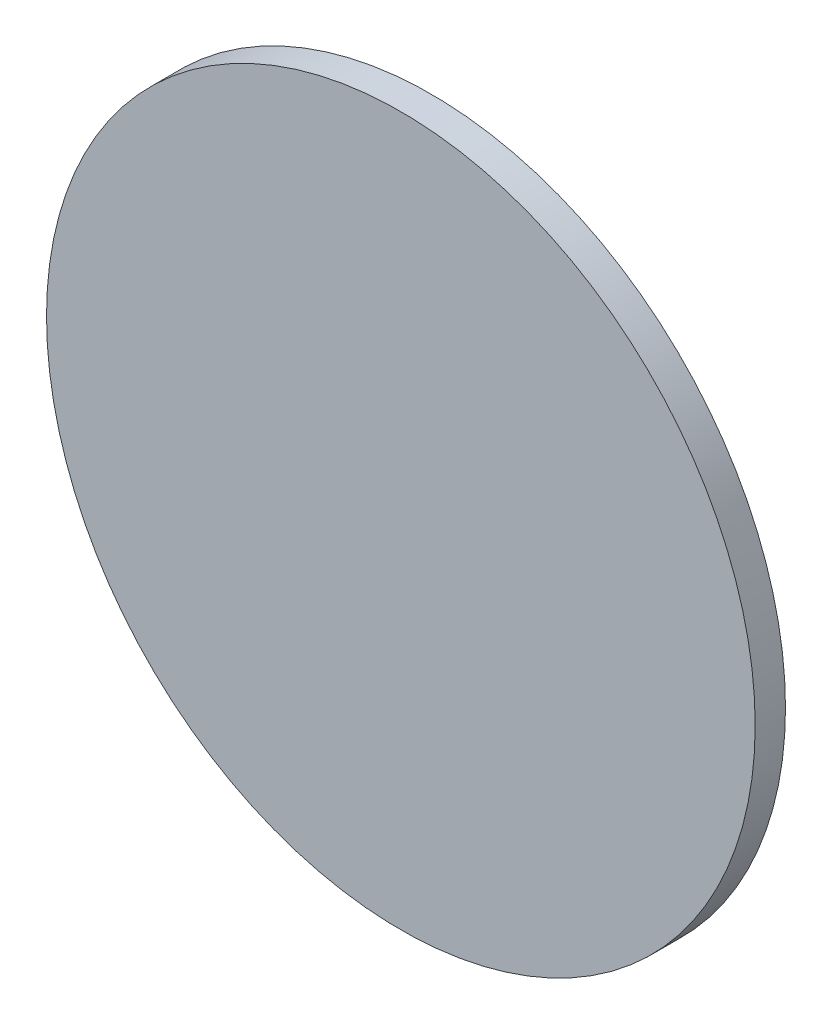
ISO-10303-21;
HEADER;
FILE_DESCRIPTION(('STEP AP214'),'2;1');
FILE_NAME('part.step','',(''),(''),'','','');
FILE_SCHEMA(('AUTOMOTIVE_DESIGN { 1 0 10303 214 1 1 1 1 }'));
ENDSEC;
DATA;
#1=APPLICATION_CONTEXT('core data for automotive mechanical design processes');
#2=APPLICATION_PROTOCOL_DEFINITION('international standard','automotive_design',2000,#1);
#3=PRODUCT_CONTEXT('',#1,'mechanical');
#4=PRODUCT('Part','Part','',(#3));
#5=PRODUCT_RELATED_PRODUCT_CATEGORY('part','',(#4));
#6=PRODUCT_DEFINITION_FORMATION('','',#4);
#7=PRODUCT_DEFINITION_CONTEXT('part definition',#1,'design');
#8=PRODUCT_DEFINITION('design','',#6,#7);
#9=PRODUCT_DEFINITION_SHAPE('','',#8);
#10=(LENGTH_UNIT() NAMED_UNIT(*) SI_UNIT(.MILLI.,.METRE.));
#11=(NAMED_UNIT(*) PLANE_ANGLE_UNIT() SI_UNIT($,.RADIAN.));
#12=(NAMED_UNIT(*) SI_UNIT($,.STERADIAN.) SOLID_ANGLE_UNIT());
#13=UNCERTAINTY_MEASURE_WITH_UNIT(LENGTH_MEASURE(1.E-05),#10,'distance_accuracy_value','');
#14=(GEOMETRIC_REPRESENTATION_CONTEXT(3) GLOBAL_UNCERTAINTY_ASSIGNED_CONTEXT((#13)) GLOBAL_UNIT_ASSIGNED_CONTEXT((#10,
#11,#12)) REPRESENTATION_CONTEXT('',''));
#15=CARTESIAN_POINT('',(0.,0.,0.));
#16=DIRECTION('',(0.,0.,1.));
#17=DIRECTION('',(1.,0.,0.));
#18=AXIS2_PLACEMENT_3D('',#15,#16,#17);
#19=CARTESIAN_POINT('',(0.,0.,6.35));
#20=DIRECTION('',(0.,0.,-1.));
#21=DIRECTION('',(-1.,0.,0.));
#22=AXIS2_PLACEMENT_3D('',#19,#20,#21);
#23=CYLINDRICAL_SURFACE('',#22,74.295);
#24=CARTESIAN_POINT('',(0.,0.,6.35));
#25=DIRECTION('',(0.,0.,1.));
#26=DIRECTION('',(1.,0.,0.));
#27=AXIS2_PLACEMENT_3D('',#24,#25,#26);
#28=CIRCLE('',#27,74.295);
#29=CARTESIAN_POINT('',(74.295,0.,6.35));
#30=VERTEX_POINT('',#29);
#31=EDGE_CURVE('E10',#30,#30,#28,.T.);
#32=ORIENTED_EDGE('',*,*,#31,.F.);
#33=EDGE_LOOP('',(#32));
#34=FACE_BOUND('',#33,.T.);
#35=CARTESIAN_POINT('',(0.,0.,0.));
#36=DIRECTION('',(0.,0.,1.));
#37=DIRECTION('',(1.,0.,0.));
#38=AXIS2_PLACEMENT_3D('',#35,#36,#37);
#39=CIRCLE('',#38,74.295);
#40=CARTESIAN_POINT('',(74.295,0.,0.));
#41=VERTEX_POINT('',#40);
#42=EDGE_CURVE('E46',#41,#41,#39,.T.);
#43=ORIENTED_EDGE('',*,*,#42,.T.);
#44=EDGE_LOOP('',(#43));
#45=FACE_BOUND('',#44,.T.);
#46=ADVANCED_FACE('F43',(#34,#45),#23,.T.);
#47=CARTESIAN_POINT('',(0.,0.,6.35));
#48=DIRECTION('',(0.,0.,1.));
#49=DIRECTION('',(1.,0.,0.));
#50=AXIS2_PLACEMENT_3D('',#47,#48,#49);
#51=PLANE('',#50);
#52=ORIENTED_EDGE('',*,*,#31,.T.);
#53=EDGE_LOOP('',(#52));
#54=FACE_BOUND('',#53,.T.);
#55=ADVANCED_FACE('F60',(#54),#51,.T.);
#56=CARTESIAN_POINT('',(0.,0.,0.));
#57=DIRECTION('',(0.,0.,1.));
#58=DIRECTION('',(1.,0.,0.));
#59=AXIS2_PLACEMENT_3D('',#56,#57,#58);
#60=PLANE('',#59);
#61=ORIENTED_EDGE('',*,*,#42,.F.);
#62=EDGE_LOOP('',(#61));
#63=FACE_BOUND('',#62,.T.);
#64=ADVANCED_FACE('F58',(#63),#60,.F.);
#65=CLOSED_SHELL('',(#46,#55,#64));
#66=MANIFOLD_SOLID_BREP('B2',#65);
#67=ADVANCED_BREP_SHAPE_REPRESENTATION('',(#18,#66),#14);
#68=SHAPE_DEFINITION_REPRESENTATION(#9,#67);
ENDSEC;
END-ISO-10303-21;
